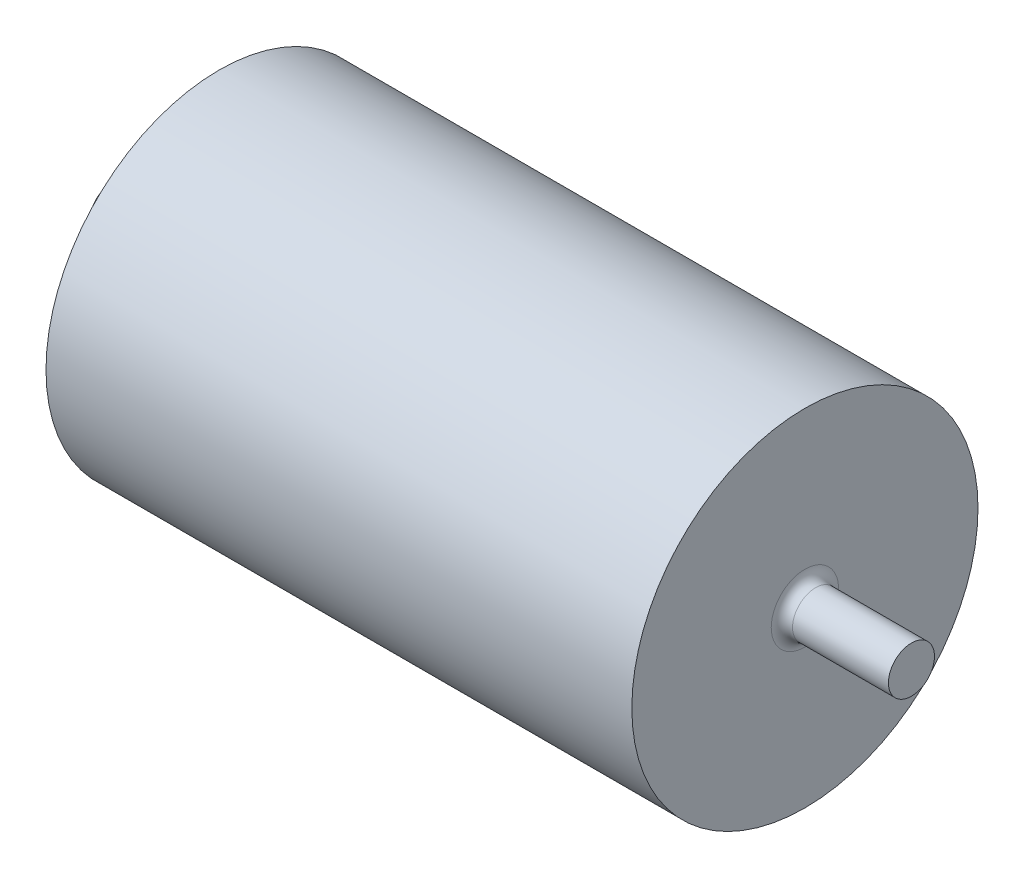
ISO-10303-21;
HEADER;
FILE_DESCRIPTION(('STEP AP214'),'2;1');
FILE_NAME('part.step','',(''),(''),'','','');
FILE_SCHEMA(('AUTOMOTIVE_DESIGN { 1 0 10303 214 1 1 1 1 }'));
ENDSEC;
DATA;
#1=APPLICATION_CONTEXT('core data for automotive mechanical design processes');
#2=APPLICATION_PROTOCOL_DEFINITION('international standard','automotive_design',2000,#1);
#3=PRODUCT_CONTEXT('',#1,'mechanical');
#4=PRODUCT('Part','Part','',(#3));
#5=PRODUCT_RELATED_PRODUCT_CATEGORY('part','',(#4));
#6=PRODUCT_DEFINITION_FORMATION('','',#4);
#7=PRODUCT_DEFINITION_CONTEXT('part definition',#1,'design');
#8=PRODUCT_DEFINITION('design','',#6,#7);
#9=PRODUCT_DEFINITION_SHAPE('','',#8);
#10=(LENGTH_UNIT() NAMED_UNIT(*) SI_UNIT(.MILLI.,.METRE.));
#11=(NAMED_UNIT(*) PLANE_ANGLE_UNIT() SI_UNIT($,.RADIAN.));
#12=(NAMED_UNIT(*) SI_UNIT($,.STERADIAN.) SOLID_ANGLE_UNIT());
#13=UNCERTAINTY_MEASURE_WITH_UNIT(LENGTH_MEASURE(1.E-05),#10,'distance_accuracy_value','');
#14=(GEOMETRIC_REPRESENTATION_CONTEXT(3) GLOBAL_UNCERTAINTY_ASSIGNED_CONTEXT((#13)) GLOBAL_UNIT_ASSIGNED_CONTEXT((#10,
#11,#12)) REPRESENTATION_CONTEXT('',''));
#15=CARTESIAN_POINT('',(0.,0.,0.));
#16=DIRECTION('',(0.,0.,1.));
#17=DIRECTION('',(1.,0.,0.));
#18=AXIS2_PLACEMENT_3D('',#15,#16,#17);
#19=CARTESIAN_POINT('',(55.,0.,0.));
#20=DIRECTION('',(-1.,0.,0.));
#21=DIRECTION('',(0.,0.,1.));
#22=AXIS2_PLACEMENT_3D('',#19,#20,#21);
#23=PLANE('',#22);
#24=CARTESIAN_POINT('',(55.,0.,0.));
#25=DIRECTION('',(-1.,0.,0.));
#26=DIRECTION('',(0.,0.,1.));
#27=AXIS2_PLACEMENT_3D('',#24,#25,#26);
#28=CIRCLE('',#27,6.325);
#29=CARTESIAN_POINT('',(55.,0.,6.325));
#30=VERTEX_POINT('',#29);
#31=EDGE_CURVE('E10',#30,#30,#28,.T.);
#32=ORIENTED_EDGE('',*,*,#31,.T.);
#33=EDGE_LOOP('',(#32));
#34=FACE_BOUND('',#33,.T.);
#35=CARTESIAN_POINT('',(55.,0.,0.));
#36=DIRECTION('',(-1.,0.,0.));
#37=DIRECTION('',(0.,0.,1.));
#38=AXIS2_PLACEMENT_3D('',#35,#36,#37);
#39=CIRCLE('',#38,32.5);
#40=CARTESIAN_POINT('',(55.,0.,32.5));
#41=VERTEX_POINT('',#40);
#42=EDGE_CURVE('E67',#41,#41,#39,.T.);
#43=ORIENTED_EDGE('',*,*,#42,.F.);
#44=EDGE_LOOP('',(#43));
#45=FACE_BOUND('',#44,.T.);
#46=ADVANCED_FACE('F43',(#34,#45),#23,.F.);
#47=CARTESIAN_POINT('',(-130.174262734584,0.,0.));
#48=DIRECTION('',(-1.,0.,0.));
#49=DIRECTION('',(0.,0.,1.));
#50=AXIS2_PLACEMENT_3D('',#47,#48,#49);
#51=CYLINDRICAL_SURFACE('',#50,32.5);
#52=CARTESIAN_POINT('',(-55.,0.,0.));
#53=DIRECTION('',(-1.,0.,0.));
#54=DIRECTION('',(0.,0.,1.));
#55=AXIS2_PLACEMENT_3D('',#52,#53,#54);
#56=CIRCLE('',#55,32.5);
#57=CARTESIAN_POINT('',(-55.,0.,32.5));
#58=VERTEX_POINT('',#57);
#59=EDGE_CURVE('E71',#58,#58,#56,.T.);
#60=ORIENTED_EDGE('',*,*,#59,.F.);
#61=EDGE_LOOP('',(#60));
#62=FACE_BOUND('',#61,.T.);
#63=ORIENTED_EDGE('',*,*,#42,.T.);
#64=EDGE_LOOP('',(#63));
#65=FACE_BOUND('',#64,.T.);
#66=ADVANCED_FACE('F100',(#62,#65),#51,.T.);
#67=CARTESIAN_POINT('',(-55.,0.,0.));
#68=DIRECTION('',(1.,0.,0.));
#69=DIRECTION('',(0.,0.,-1.));
#70=AXIS2_PLACEMENT_3D('',#67,#68,#69);
#71=PLANE('',#70);
#72=CARTESIAN_POINT('',(-55.,0.,0.));
#73=DIRECTION('',(1.,0.,0.));
#74=DIRECTION('',(0.,0.,-1.));
#75=AXIS2_PLACEMENT_3D('',#72,#73,#74);
#76=CIRCLE('',#75,6.325);
#77=CARTESIAN_POINT('',(-55.,0.,-6.325));
#78=VERTEX_POINT('',#77);
#79=EDGE_CURVE('E61',#78,#78,#76,.T.);
#80=ORIENTED_EDGE('',*,*,#79,.T.);
#81=EDGE_LOOP('',(#80));
#82=FACE_BOUND('',#81,.T.);
#83=ORIENTED_EDGE('',*,*,#59,.T.);
#84=EDGE_LOOP('',(#83));
#85=FACE_BOUND('',#84,.T.);
#86=ADVANCED_FACE('F106',(#82,#85),#71,.F.);
#87=CARTESIAN_POINT('',(75.,0.,0.));
#88=DIRECTION('',(-1.,0.,0.));
#89=DIRECTION('',(0.,0.,1.));
#90=AXIS2_PLACEMENT_3D('',#87,#88,#89);
#91=CYLINDRICAL_SURFACE('',#90,4.325);
#92=CARTESIAN_POINT('',(57.,0.,0.));
#93=DIRECTION('',(-1.,0.,0.));
#94=DIRECTION('',(0.,0.,1.));
#95=AXIS2_PLACEMENT_3D('',#92,#93,#94);
#96=CIRCLE('',#95,4.325);
#97=CARTESIAN_POINT('',(57.,0.,4.325));
#98=VERTEX_POINT('',#97);
#99=EDGE_CURVE('E51',#98,#98,#96,.F.);
#100=ORIENTED_EDGE('',*,*,#99,.T.);
#101=EDGE_LOOP('',(#100));
#102=FACE_BOUND('',#101,.T.);
#103=CARTESIAN_POINT('',(75.,0.,0.));
#104=DIRECTION('',(1.,0.,0.));
#105=DIRECTION('',(0.,0.,-1.));
#106=AXIS2_PLACEMENT_3D('',#103,#104,#105);
#107=CIRCLE('',#106,4.325);
#108=CARTESIAN_POINT('',(75.,0.,-4.325));
#109=VERTEX_POINT('',#108);
#110=EDGE_CURVE('E75',#109,#109,#107,.T.);
#111=ORIENTED_EDGE('',*,*,#110,.F.);
#112=EDGE_LOOP('',(#111));
#113=FACE_BOUND('',#112,.T.);
#114=ADVANCED_FACE('F112',(#102,#113),#91,.T.);
#115=CARTESIAN_POINT('',(75.,0.,0.));
#116=DIRECTION('',(1.,0.,0.));
#117=DIRECTION('',(0.,0.,-1.));
#118=AXIS2_PLACEMENT_3D('',#115,#116,#117);
#119=PLANE('',#118);
#120=ORIENTED_EDGE('',*,*,#110,.T.);
#121=EDGE_LOOP('',(#120));
#122=FACE_BOUND('',#121,.T.);
#123=ADVANCED_FACE('F97',(#122),#119,.T.);
#124=CARTESIAN_POINT('',(-75.,0.,0.));
#125=DIRECTION('',(1.,0.,0.));
#126=DIRECTION('',(0.,0.,-1.));
#127=AXIS2_PLACEMENT_3D('',#124,#125,#126);
#128=CYLINDRICAL_SURFACE('',#127,4.325);
#129=CARTESIAN_POINT('',(-57.,0.,0.));
#130=DIRECTION('',(1.,0.,0.));
#131=DIRECTION('',(0.,0.,-1.));
#132=AXIS2_PLACEMENT_3D('',#129,#130,#131);
#133=CIRCLE('',#132,4.325);
#134=CARTESIAN_POINT('',(-57.,0.,-4.325));
#135=VERTEX_POINT('',#134);
#136=EDGE_CURVE('E56',#135,#135,#133,.F.);
#137=ORIENTED_EDGE('',*,*,#136,.T.);
#138=EDGE_LOOP('',(#137));
#139=FACE_BOUND('',#138,.T.);
#140=CARTESIAN_POINT('',(-75.,0.,0.));
#141=DIRECTION('',(1.,0.,0.));
#142=DIRECTION('',(0.,0.,-1.));
#143=AXIS2_PLACEMENT_3D('',#140,#141,#142);
#144=CIRCLE('',#143,4.325);
#145=CARTESIAN_POINT('',(-75.,0.,-4.325));
#146=VERTEX_POINT('',#145);
#147=EDGE_CURVE('E79',#146,#146,#144,.T.);
#148=ORIENTED_EDGE('',*,*,#147,.T.);
#149=EDGE_LOOP('',(#148));
#150=FACE_BOUND('',#149,.T.);
#151=ADVANCED_FACE('F84',(#139,#150),#128,.T.);
#152=CARTESIAN_POINT('',(-75.,0.,0.));
#153=DIRECTION('',(-1.,0.,0.));
#154=DIRECTION('',(0.,0.,-1.));
#155=AXIS2_PLACEMENT_3D('',#152,#153,#154);
#156=PLANE('',#155);
#157=ORIENTED_EDGE('',*,*,#147,.F.);
#158=EDGE_LOOP('',(#157));
#159=FACE_BOUND('',#158,.T.);
#160=ADVANCED_FACE('F86',(#159),#156,.T.);
#161=CARTESIAN_POINT('',(-57.,0.,0.));
#162=DIRECTION('',(1.,0.,0.));
#163=DIRECTION('',(0.,0.,-1.));
#164=AXIS2_PLACEMENT_3D('',#161,#162,#163);
#165=TOROIDAL_SURFACE('',#164,6.325,2.);
#166=ORIENTED_EDGE('',*,*,#136,.F.);
#167=EDGE_LOOP('',(#166));
#168=FACE_BOUND('',#167,.T.);
#169=ORIENTED_EDGE('',*,*,#79,.F.);
#170=EDGE_LOOP('',(#169));
#171=FACE_BOUND('',#170,.T.);
#172=ADVANCED_FACE('F88',(#168,#171),#165,.F.);
#173=CARTESIAN_POINT('',(57.,0.,0.));
#174=DIRECTION('',(-1.,0.,0.));
#175=DIRECTION('',(0.,0.,1.));
#176=AXIS2_PLACEMENT_3D('',#173,#174,#175);
#177=TOROIDAL_SURFACE('',#176,6.325,2.);
#178=ORIENTED_EDGE('',*,*,#31,.F.);
#179=EDGE_LOOP('',(#178));
#180=FACE_BOUND('',#179,.T.);
#181=ORIENTED_EDGE('',*,*,#99,.F.);
#182=EDGE_LOOP('',(#181));
#183=FACE_BOUND('',#182,.T.);
#184=ADVANCED_FACE('F45',(#180,#183),#177,.F.);
#185=CLOSED_SHELL('',(#46,#66,#86,#114,#123,#151,#160,#172,#184));
#186=MANIFOLD_SOLID_BREP('B2',#185);
#187=ADVANCED_BREP_SHAPE_REPRESENTATION('',(#18,#186),#14);
#188=SHAPE_DEFINITION_REPRESENTATION(#9,#187);
ENDSEC;
END-ISO-10303-21;
